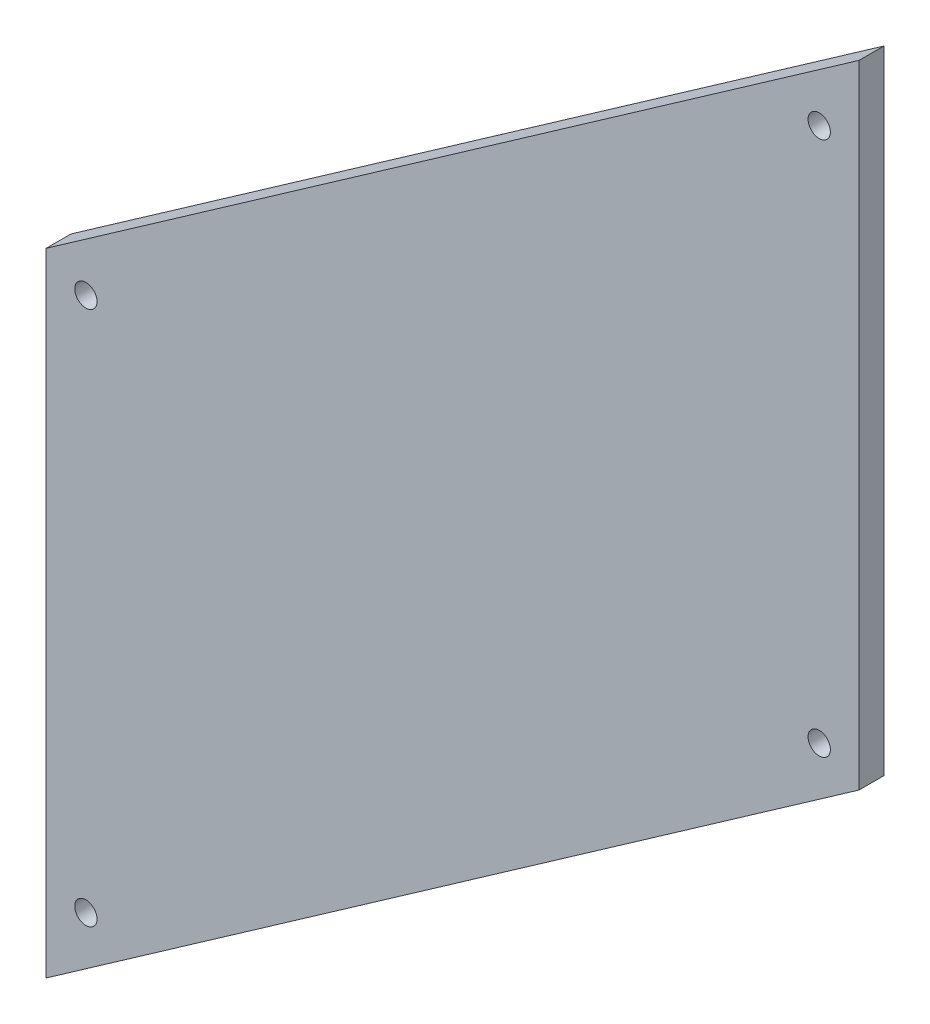
ISO-10303-21;
HEADER;
FILE_DESCRIPTION(('STEP AP214'),'2;1');
FILE_NAME('part.step','',(''),(''),'','','');
FILE_SCHEMA(('AUTOMOTIVE_DESIGN { 1 0 10303 214 1 1 1 1 }'));
ENDSEC;
DATA;
#1=APPLICATION_CONTEXT('core data for automotive mechanical design processes');
#2=APPLICATION_PROTOCOL_DEFINITION('international standard','automotive_design',2000,#1);
#3=PRODUCT_CONTEXT('',#1,'mechanical');
#4=PRODUCT('Part','Part','',(#3));
#5=PRODUCT_RELATED_PRODUCT_CATEGORY('part','',(#4));
#6=PRODUCT_DEFINITION_FORMATION('','',#4);
#7=PRODUCT_DEFINITION_CONTEXT('part definition',#1,'design');
#8=PRODUCT_DEFINITION('design','',#6,#7);
#9=PRODUCT_DEFINITION_SHAPE('','',#8);
#10=(LENGTH_UNIT() NAMED_UNIT(*) SI_UNIT(.MILLI.,.METRE.));
#11=(NAMED_UNIT(*) PLANE_ANGLE_UNIT() SI_UNIT($,.RADIAN.));
#12=(NAMED_UNIT(*) SI_UNIT($,.STERADIAN.) SOLID_ANGLE_UNIT());
#13=UNCERTAINTY_MEASURE_WITH_UNIT(LENGTH_MEASURE(1.E-05),#10,'distance_accuracy_value','');
#14=(GEOMETRIC_REPRESENTATION_CONTEXT(3) GLOBAL_UNCERTAINTY_ASSIGNED_CONTEXT((#13)) GLOBAL_UNIT_ASSIGNED_CONTEXT((#10,
#11,#12)) REPRESENTATION_CONTEXT('',''));
#15=CARTESIAN_POINT('',(0.,0.,0.));
#16=DIRECTION('',(0.,0.,1.));
#17=DIRECTION('',(1.,0.,0.));
#18=AXIS2_PLACEMENT_3D('',#15,#16,#17);
#19=CARTESIAN_POINT('',(0.,0.,11.90625));
#20=DIRECTION('',(0.,0.,-1.));
#21=DIRECTION('',(-1.,0.,0.));
#22=AXIS2_PLACEMENT_3D('',#19,#20,#21);
#23=PLANE('',#22);
#24=DIRECTION('',(0.819152044288989,0.57357643635105,0.));
#25=VECTOR('',#24,1.);
#26=CARTESIAN_POINT('',(388.9375,272.336969392442,11.90625));
#27=LINE('',#26,#25);
#28=CARTESIAN_POINT('',(0.,0.,11.90625));
#29=VERTEX_POINT('',#28);
#30=CARTESIAN_POINT('',(388.9375,272.336969392442,11.90625));
#31=VERTEX_POINT('',#30);
#32=EDGE_CURVE('E85',#29,#31,#27,.T.);
#33=ORIENTED_EDGE('',*,*,#32,.T.);
#34=DIRECTION('',(0.,1.,0.));
#35=VECTOR('',#34,1.);
#36=CARTESIAN_POINT('',(388.9375,574.661796299217,11.90625));
#37=LINE('',#36,#35);
#38=CARTESIAN_POINT('',(388.9375,574.661796299217,11.90625));
#39=VERTEX_POINT('',#38);
#40=EDGE_CURVE('E80',#31,#39,#37,.T.);
#41=ORIENTED_EDGE('',*,*,#40,.T.);
#42=DIRECTION('',(-0.819152044288989,-0.57357643635105,0.));
#43=VECTOR('',#42,1.);
#44=CARTESIAN_POINT('',(0.,302.324826906776,11.90625));
#45=LINE('',#44,#43);
#46=CARTESIAN_POINT('',(0.,302.324826906776,11.90625));
#47=VERTEX_POINT('',#46);
#48=EDGE_CURVE('E83',#39,#47,#45,.T.);
#49=ORIENTED_EDGE('',*,*,#48,.T.);
#50=DIRECTION('',(0.,-1.,0.));
#51=VECTOR('',#50,1.);
#52=CARTESIAN_POINT('',(0.,0.,11.90625));
#53=LINE('',#52,#51);
#54=EDGE_CURVE('E50',#47,#29,#53,.T.);
#55=ORIENTED_EDGE('',*,*,#54,.T.);
#56=EDGE_LOOP('',(#33,#41,#49,#55));
#57=FACE_BOUND('',#56,.T.);
#58=CARTESIAN_POINT('',(19.05,292.408024593765,11.90625));
#59=DIRECTION('',(0.,0.,1.));
#60=DIRECTION('',(1.,0.,0.));
#61=AXIS2_PLACEMENT_3D('',#58,#59,#60);
#62=CIRCLE('',#61,5.33400000000001);
#63=CARTESIAN_POINT('',(24.384,292.408024593765,11.90625));
#64=VERTEX_POINT('',#63);
#65=EDGE_CURVE('E100',#64,#64,#62,.T.);
#66=ORIENTED_EDGE('',*,*,#65,.F.);
#67=EDGE_LOOP('',(#66));
#68=FACE_BOUND('',#67,.T.);
#69=CARTESIAN_POINT('',(19.05,36.5947095188009,11.90625));
#70=DIRECTION('',(0.,0.,1.));
#71=DIRECTION('',(1.,0.,0.));
#72=AXIS2_PLACEMENT_3D('',#69,#70,#71);
#73=CIRCLE('',#72,5.334);
#74=CARTESIAN_POINT('',(24.384,36.5947095188009,11.90625));
#75=VERTEX_POINT('',#74);
#76=EDGE_CURVE('E115',#75,#75,#73,.T.);
#77=ORIENTED_EDGE('',*,*,#76,.F.);
#78=EDGE_LOOP('',(#77));
#79=FACE_BOUND('',#78,.T.);
#80=CARTESIAN_POINT('',(369.8875,282.253771705452,11.90625));
#81=DIRECTION('',(0.,0.,1.));
#82=DIRECTION('',(1.,0.,0.));
#83=AXIS2_PLACEMENT_3D('',#80,#81,#82);
#84=CIRCLE('',#83,5.334);
#85=CARTESIAN_POINT('',(375.2215,282.253771705452,11.90625));
#86=VERTEX_POINT('',#85);
#87=EDGE_CURVE('E121',#86,#86,#84,.T.);
#88=ORIENTED_EDGE('',*,*,#87,.F.);
#89=EDGE_LOOP('',(#88));
#90=FACE_BOUND('',#89,.T.);
#91=CARTESIAN_POINT('',(369.8875,538.067086780417,11.90625));
#92=DIRECTION('',(0.,0.,1.));
#93=DIRECTION('',(1.,0.,0.));
#94=AXIS2_PLACEMENT_3D('',#91,#92,#93);
#95=CIRCLE('',#94,5.334);
#96=CARTESIAN_POINT('',(375.2215,538.067086780417,11.90625));
#97=VERTEX_POINT('',#96);
#98=EDGE_CURVE('E127',#97,#97,#95,.T.);
#99=ORIENTED_EDGE('',*,*,#98,.F.);
#100=EDGE_LOOP('',(#99));
#101=FACE_BOUND('',#100,.T.);
#102=ADVANCED_FACE('F33',(#57,#68,#79,#90,#101),#23,.F.);
#103=CARTESIAN_POINT('',(0.,0.,0.));
#104=DIRECTION('',(0.,0.,-1.));
#105=DIRECTION('',(-1.,0.,0.));
#106=AXIS2_PLACEMENT_3D('',#103,#104,#105);
#107=PLANE('',#106);
#108=CARTESIAN_POINT('',(369.8875,282.253771705452,0.));
#109=DIRECTION('',(0.,0.,1.));
#110=DIRECTION('',(1.,0.,0.));
#111=AXIS2_PLACEMENT_3D('',#108,#109,#110);
#112=CIRCLE('',#111,5.334);
#113=CARTESIAN_POINT('',(375.2215,282.253771705452,0.));
#114=VERTEX_POINT('',#113);
#115=EDGE_CURVE('E124',#114,#114,#112,.T.);
#116=ORIENTED_EDGE('',*,*,#115,.T.);
#117=EDGE_LOOP('',(#116));
#118=FACE_BOUND('',#117,.T.);
#119=CARTESIAN_POINT('',(19.05,292.408024593765,0.));
#120=DIRECTION('',(0.,0.,1.));
#121=DIRECTION('',(1.,0.,0.));
#122=AXIS2_PLACEMENT_3D('',#119,#120,#121);
#123=CIRCLE('',#122,5.33400000000001);
#124=CARTESIAN_POINT('',(24.384,292.408024593765,0.));
#125=VERTEX_POINT('',#124);
#126=EDGE_CURVE('E112',#125,#125,#123,.T.);
#127=ORIENTED_EDGE('',*,*,#126,.T.);
#128=EDGE_LOOP('',(#127));
#129=FACE_BOUND('',#128,.T.);
#130=DIRECTION('',(0.819152044288989,0.57357643635105,0.));
#131=VECTOR('',#130,1.);
#132=CARTESIAN_POINT('',(388.9375,272.336969392442,0.));
#133=LINE('',#132,#131);
#134=CARTESIAN_POINT('',(0.,0.,0.));
#135=VERTEX_POINT('',#134);
#136=CARTESIAN_POINT('',(388.9375,272.336969392442,0.));
#137=VERTEX_POINT('',#136);
#138=EDGE_CURVE('E97',#135,#137,#133,.T.);
#139=ORIENTED_EDGE('',*,*,#138,.F.);
#140=DIRECTION('',(0.,-1.,0.));
#141=VECTOR('',#140,1.);
#142=CARTESIAN_POINT('',(0.,0.,0.));
#143=LINE('',#142,#141);
#144=CARTESIAN_POINT('',(0.,302.324826906776,0.));
#145=VERTEX_POINT('',#144);
#146=EDGE_CURVE('E73',#145,#135,#143,.T.);
#147=ORIENTED_EDGE('',*,*,#146,.F.);
#148=DIRECTION('',(-0.819152044288989,-0.57357643635105,0.));
#149=VECTOR('',#148,1.);
#150=CARTESIAN_POINT('',(0.,302.324826906776,0.));
#151=LINE('',#150,#149);
#152=CARTESIAN_POINT('',(388.9375,574.661796299217,0.));
#153=VERTEX_POINT('',#152);
#154=EDGE_CURVE('E67',#153,#145,#151,.T.);
#155=ORIENTED_EDGE('',*,*,#154,.F.);
#156=DIRECTION('',(0.,1.,0.));
#157=VECTOR('',#156,1.);
#158=CARTESIAN_POINT('',(388.9375,574.661796299217,0.));
#159=LINE('',#158,#157);
#160=EDGE_CURVE('E89',#137,#153,#159,.T.);
#161=ORIENTED_EDGE('',*,*,#160,.F.);
#162=EDGE_LOOP('',(#139,#147,#155,#161));
#163=FACE_BOUND('',#162,.T.);
#164=CARTESIAN_POINT('',(19.05,36.5947095188009,0.));
#165=DIRECTION('',(0.,0.,1.));
#166=DIRECTION('',(1.,0.,0.));
#167=AXIS2_PLACEMENT_3D('',#164,#165,#166);
#168=CIRCLE('',#167,5.334);
#169=CARTESIAN_POINT('',(24.384,36.5947095188009,0.));
#170=VERTEX_POINT('',#169);
#171=EDGE_CURVE('E118',#170,#170,#168,.T.);
#172=ORIENTED_EDGE('',*,*,#171,.T.);
#173=EDGE_LOOP('',(#172));
#174=FACE_BOUND('',#173,.T.);
#175=CARTESIAN_POINT('',(369.8875,538.067086780417,0.));
#176=DIRECTION('',(0.,0.,1.));
#177=DIRECTION('',(1.,0.,0.));
#178=AXIS2_PLACEMENT_3D('',#175,#176,#177);
#179=CIRCLE('',#178,5.334);
#180=CARTESIAN_POINT('',(375.2215,538.067086780417,0.));
#181=VERTEX_POINT('',#180);
#182=EDGE_CURVE('E130',#181,#181,#179,.T.);
#183=ORIENTED_EDGE('',*,*,#182,.T.);
#184=EDGE_LOOP('',(#183));
#185=FACE_BOUND('',#184,.T.);
#186=ADVANCED_FACE('F108',(#118,#129,#163,#174,#185),#107,.T.);
#187=CARTESIAN_POINT('',(388.9375,272.336969392442,11.90625));
#188=DIRECTION('',(-0.57357643635105,0.819152044288989,0.));
#189=DIRECTION('',(-0.819152044288989,-0.57357643635105,0.));
#190=AXIS2_PLACEMENT_3D('',#187,#188,#189);
#191=PLANE('',#190);
#192=ORIENTED_EDGE('',*,*,#138,.T.);
#193=DIRECTION('',(0.,0.,-1.));
#194=VECTOR('',#193,1.);
#195=CARTESIAN_POINT('',(388.9375,272.336969392442,11.90625));
#196=LINE('',#195,#194);
#197=EDGE_CURVE('E11',#31,#137,#196,.T.);
#198=ORIENTED_EDGE('',*,*,#197,.F.);
#199=ORIENTED_EDGE('',*,*,#32,.F.);
#200=DIRECTION('',(0.,0.,-1.));
#201=VECTOR('',#200,1.);
#202=CARTESIAN_POINT('',(0.,0.,11.90625));
#203=LINE('',#202,#201);
#204=EDGE_CURVE('E93',#29,#135,#203,.T.);
#205=ORIENTED_EDGE('',*,*,#204,.T.);
#206=EDGE_LOOP('',(#192,#198,#199,#205));
#207=FACE_BOUND('',#206,.T.);
#208=ADVANCED_FACE('F35',(#207),#191,.F.);
#209=CARTESIAN_POINT('',(388.9375,574.661796299217,11.90625));
#210=DIRECTION('',(-1.,0.,0.));
#211=DIRECTION('',(0.,0.,1.));
#212=AXIS2_PLACEMENT_3D('',#209,#210,#211);
#213=PLANE('',#212);
#214=ORIENTED_EDGE('',*,*,#160,.T.);
#215=DIRECTION('',(0.,0.,-1.));
#216=VECTOR('',#215,1.);
#217=CARTESIAN_POINT('',(388.9375,574.661796299217,11.90625));
#218=LINE('',#217,#216);
#219=EDGE_CURVE('E42',#39,#153,#218,.T.);
#220=ORIENTED_EDGE('',*,*,#219,.F.);
#221=ORIENTED_EDGE('',*,*,#40,.F.);
#222=ORIENTED_EDGE('',*,*,#197,.T.);
#223=EDGE_LOOP('',(#214,#220,#221,#222));
#224=FACE_BOUND('',#223,.T.);
#225=ADVANCED_FACE('F88',(#224),#213,.F.);
#226=CARTESIAN_POINT('',(0.,302.324826906776,11.90625));
#227=DIRECTION('',(0.57357643635105,-0.819152044288989,0.));
#228=DIRECTION('',(0.819152044288989,0.57357643635105,0.));
#229=AXIS2_PLACEMENT_3D('',#226,#227,#228);
#230=PLANE('',#229);
#231=ORIENTED_EDGE('',*,*,#154,.T.);
#232=DIRECTION('',(0.,0.,-1.));
#233=VECTOR('',#232,1.);
#234=CARTESIAN_POINT('',(0.,302.324826906776,11.90625));
#235=LINE('',#234,#233);
#236=EDGE_CURVE('E90',#47,#145,#235,.T.);
#237=ORIENTED_EDGE('',*,*,#236,.F.);
#238=ORIENTED_EDGE('',*,*,#48,.F.);
#239=ORIENTED_EDGE('',*,*,#219,.T.);
#240=EDGE_LOOP('',(#231,#237,#238,#239));
#241=FACE_BOUND('',#240,.T.);
#242=ADVANCED_FACE('F91',(#241),#230,.F.);
#243=CARTESIAN_POINT('',(0.,0.,11.90625));
#244=DIRECTION('',(1.,0.,0.));
#245=DIRECTION('',(0.,1.,0.));
#246=AXIS2_PLACEMENT_3D('',#243,#244,#245);
#247=PLANE('',#246);
#248=ORIENTED_EDGE('',*,*,#146,.T.);
#249=ORIENTED_EDGE('',*,*,#204,.F.);
#250=ORIENTED_EDGE('',*,*,#54,.F.);
#251=ORIENTED_EDGE('',*,*,#236,.T.);
#252=EDGE_LOOP('',(#248,#249,#250,#251));
#253=FACE_BOUND('',#252,.T.);
#254=ADVANCED_FACE('F105',(#253),#247,.F.);
#255=CARTESIAN_POINT('',(19.05,292.408024593765,11.90625));
#256=DIRECTION('',(0.,0.,-1.));
#257=DIRECTION('',(-1.,0.,0.));
#258=AXIS2_PLACEMENT_3D('',#255,#256,#257);
#259=CYLINDRICAL_SURFACE('',#258,5.33400000000001);
#260=ORIENTED_EDGE('',*,*,#65,.T.);
#261=EDGE_LOOP('',(#260));
#262=FACE_BOUND('',#261,.T.);
#263=ORIENTED_EDGE('',*,*,#126,.F.);
#264=EDGE_LOOP('',(#263));
#265=FACE_BOUND('',#264,.T.);
#266=ADVANCED_FACE('F147',(#262,#265),#259,.F.);
#267=CARTESIAN_POINT('',(19.05,36.5947095188009,11.90625));
#268=DIRECTION('',(0.,0.,-1.));
#269=DIRECTION('',(-1.,0.,0.));
#270=AXIS2_PLACEMENT_3D('',#267,#268,#269);
#271=CYLINDRICAL_SURFACE('',#270,5.334);
#272=ORIENTED_EDGE('',*,*,#76,.T.);
#273=EDGE_LOOP('',(#272));
#274=FACE_BOUND('',#273,.T.);
#275=ORIENTED_EDGE('',*,*,#171,.F.);
#276=EDGE_LOOP('',(#275));
#277=FACE_BOUND('',#276,.T.);
#278=ADVANCED_FACE('F193',(#274,#277),#271,.F.);
#279=CARTESIAN_POINT('',(369.8875,282.253771705452,11.90625));
#280=DIRECTION('',(0.,0.,-1.));
#281=DIRECTION('',(-1.,0.,0.));
#282=AXIS2_PLACEMENT_3D('',#279,#280,#281);
#283=CYLINDRICAL_SURFACE('',#282,5.334);
#284=ORIENTED_EDGE('',*,*,#87,.T.);
#285=EDGE_LOOP('',(#284));
#286=FACE_BOUND('',#285,.T.);
#287=ORIENTED_EDGE('',*,*,#115,.F.);
#288=EDGE_LOOP('',(#287));
#289=FACE_BOUND('',#288,.T.);
#290=ADVANCED_FACE('F201',(#286,#289),#283,.F.);
#291=CARTESIAN_POINT('',(369.8875,538.067086780417,11.90625));
#292=DIRECTION('',(0.,0.,-1.));
#293=DIRECTION('',(-1.,0.,0.));
#294=AXIS2_PLACEMENT_3D('',#291,#292,#293);
#295=CYLINDRICAL_SURFACE('',#294,5.334);
#296=ORIENTED_EDGE('',*,*,#98,.T.);
#297=EDGE_LOOP('',(#296));
#298=FACE_BOUND('',#297,.T.);
#299=ORIENTED_EDGE('',*,*,#182,.F.);
#300=EDGE_LOOP('',(#299));
#301=FACE_BOUND('',#300,.T.);
#302=ADVANCED_FACE('F136',(#298,#301),#295,.F.);
#303=CLOSED_SHELL('',(#102,#186,#208,#225,#242,#254,#266,#278,#290,#302));
#304=MANIFOLD_SOLID_BREP('B2',#303);
#305=ADVANCED_BREP_SHAPE_REPRESENTATION('',(#18,#304),#14);
#306=SHAPE_DEFINITION_REPRESENTATION(#9,#305);
ENDSEC;
END-ISO-10303-21;
